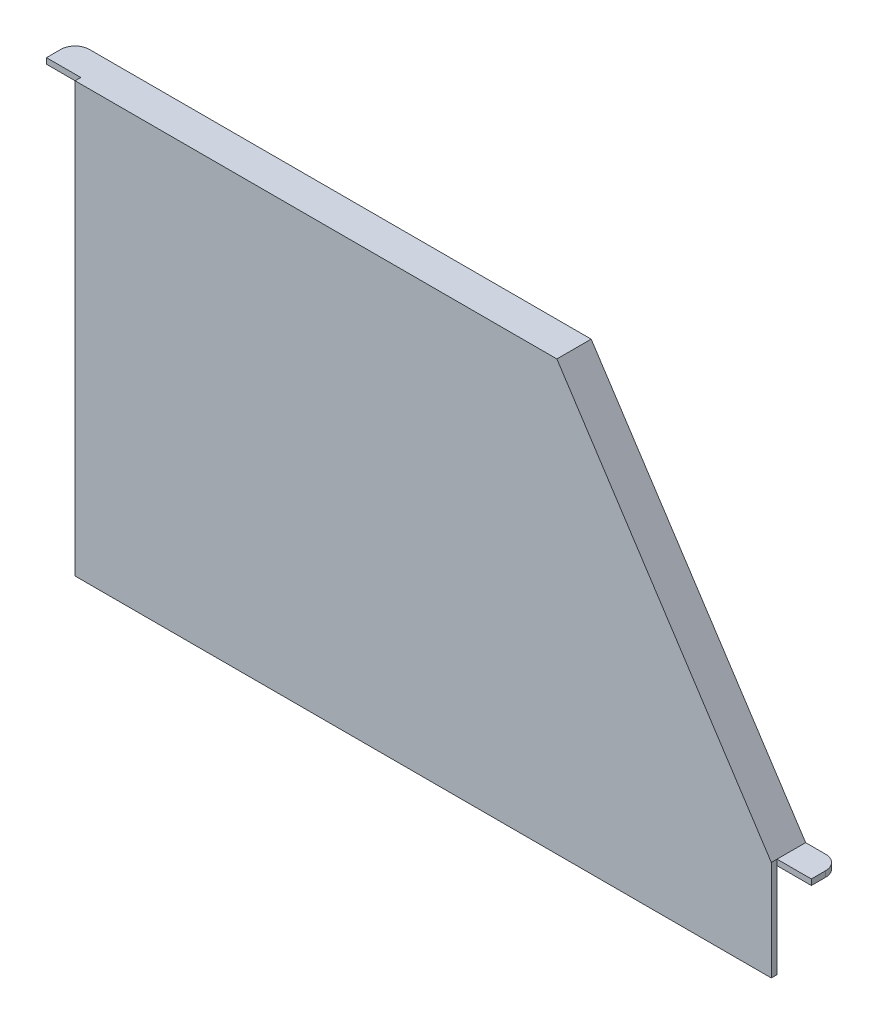
ISO-10303-21;
HEADER;
FILE_DESCRIPTION(('STEP AP214'),'2;1');
FILE_NAME('part.step','',(''),(''),'','','');
FILE_SCHEMA(('AUTOMOTIVE_DESIGN { 1 0 10303 214 1 1 1 1 }'));
ENDSEC;
DATA;
#1=APPLICATION_CONTEXT('core data for automotive mechanical design processes');
#2=APPLICATION_PROTOCOL_DEFINITION('international standard','automotive_design',2000,#1);
#3=PRODUCT_CONTEXT('',#1,'mechanical');
#4=PRODUCT('Part','Part','',(#3));
#5=PRODUCT_RELATED_PRODUCT_CATEGORY('part','',(#4));
#6=PRODUCT_DEFINITION_FORMATION('','',#4);
#7=PRODUCT_DEFINITION_CONTEXT('part definition',#1,'design');
#8=PRODUCT_DEFINITION('design','',#6,#7);
#9=PRODUCT_DEFINITION_SHAPE('','',#8);
#10=(LENGTH_UNIT() NAMED_UNIT(*) SI_UNIT(.MILLI.,.METRE.));
#11=(NAMED_UNIT(*) PLANE_ANGLE_UNIT() SI_UNIT($,.RADIAN.));
#12=(NAMED_UNIT(*) SI_UNIT($,.STERADIAN.) SOLID_ANGLE_UNIT());
#13=UNCERTAINTY_MEASURE_WITH_UNIT(LENGTH_MEASURE(1.E-05),#10,'distance_accuracy_value','');
#14=(GEOMETRIC_REPRESENTATION_CONTEXT(3) GLOBAL_UNCERTAINTY_ASSIGNED_CONTEXT((#13)) GLOBAL_UNIT_ASSIGNED_CONTEXT((#10,
#11,#12)) REPRESENTATION_CONTEXT('',''));
#15=CARTESIAN_POINT('',(0.,0.,0.));
#16=DIRECTION('',(0.,0.,1.));
#17=DIRECTION('',(1.,0.,0.));
#18=AXIS2_PLACEMENT_3D('',#15,#16,#17);
#19=CARTESIAN_POINT('',(0.,0.,4.));
#20=DIRECTION('',(1.,0.,0.));
#21=DIRECTION('',(0.,0.,-1.));
#22=AXIS2_PLACEMENT_3D('',#19,#20,#21);
#23=PLANE('',#22);
#24=DIRECTION('',(0.,1.,0.));
#25=VECTOR('',#24,1.);
#26=CARTESIAN_POINT('',(0.,296.,0.));
#27=LINE('',#26,#25);
#28=CARTESIAN_POINT('',(0.,296.,0.));
#29=VERTEX_POINT('',#28);
#30=CARTESIAN_POINT('',(0.,300.,0.));
#31=VERTEX_POINT('',#30);
#32=EDGE_CURVE('E142',#29,#31,#27,.T.);
#33=ORIENTED_EDGE('',*,*,#32,.F.);
#34=DIRECTION('',(0.,-1.,0.));
#35=VECTOR('',#34,1.);
#36=CARTESIAN_POINT('',(0.,0.,0.));
#37=LINE('',#36,#35);
#38=CARTESIAN_POINT('',(0.,0.,0.));
#39=VERTEX_POINT('',#38);
#40=EDGE_CURVE('E210',#29,#39,#37,.T.);
#41=ORIENTED_EDGE('',*,*,#40,.T.);
#42=DIRECTION('',(0.,0.,-1.));
#43=VECTOR('',#42,1.);
#44=CARTESIAN_POINT('',(0.,0.,4.));
#45=LINE('',#44,#43);
#46=CARTESIAN_POINT('',(0.,0.,4.));
#47=VERTEX_POINT('',#46);
#48=EDGE_CURVE('E218',#47,#39,#45,.T.);
#49=ORIENTED_EDGE('',*,*,#48,.F.);
#50=DIRECTION('',(0.,-1.,0.));
#51=VECTOR('',#50,1.);
#52=CARTESIAN_POINT('',(0.,0.,4.));
#53=LINE('',#52,#51);
#54=CARTESIAN_POINT('',(0.,300.,4.));
#55=VERTEX_POINT('',#54);
#56=EDGE_CURVE('E216',#55,#47,#53,.T.);
#57=ORIENTED_EDGE('',*,*,#56,.F.);
#58=DIRECTION('',(0.,0.,-1.));
#59=VECTOR('',#58,1.);
#60=CARTESIAN_POINT('',(0.,300.,4.));
#61=LINE('',#60,#59);
#62=EDGE_CURVE('E226',#55,#31,#61,.T.);
#63=ORIENTED_EDGE('',*,*,#62,.T.);
#64=EDGE_LOOP('',(#33,#41,#49,#57,#63));
#65=FACE_BOUND('',#64,.T.);
#66=ADVANCED_FACE('F34',(#65),#23,.F.);
#67=CARTESIAN_POINT('',(487.,70.,4.));
#68=DIRECTION('',(-1.,0.,0.));
#69=DIRECTION('',(0.,0.,1.));
#70=AXIS2_PLACEMENT_3D('',#67,#68,#69);
#71=PLANE('',#70);
#72=DIRECTION('',(0.,-1.,0.));
#73=VECTOR('',#72,1.);
#74=CARTESIAN_POINT('',(487.,70.,0.));
#75=LINE('',#74,#73);
#76=CARTESIAN_POINT('',(487.,70.,0.));
#77=VERTEX_POINT('',#76);
#78=CARTESIAN_POINT('',(487.,65.9999999999999,0.));
#79=VERTEX_POINT('',#78);
#80=EDGE_CURVE('E167',#77,#79,#75,.T.);
#81=ORIENTED_EDGE('',*,*,#80,.F.);
#82=DIRECTION('',(0.,0.,-1.));
#83=VECTOR('',#82,1.);
#84=CARTESIAN_POINT('',(487.,70.,4.));
#85=LINE('',#84,#83);
#86=CARTESIAN_POINT('',(487.,70.,4.));
#87=VERTEX_POINT('',#86);
#88=EDGE_CURVE('E231',#87,#77,#85,.T.);
#89=ORIENTED_EDGE('',*,*,#88,.F.);
#90=DIRECTION('',(0.,1.,0.));
#91=VECTOR('',#90,1.);
#92=CARTESIAN_POINT('',(487.,70.,4.));
#93=LINE('',#92,#91);
#94=CARTESIAN_POINT('',(487.,0.,4.));
#95=VERTEX_POINT('',#94);
#96=EDGE_CURVE('E209',#95,#87,#93,.T.);
#97=ORIENTED_EDGE('',*,*,#96,.F.);
#98=DIRECTION('',(0.,0.,-1.));
#99=VECTOR('',#98,1.);
#100=CARTESIAN_POINT('',(487.,0.,4.));
#101=LINE('',#100,#99);
#102=CARTESIAN_POINT('',(487.,0.,0.));
#103=VERTEX_POINT('',#102);
#104=EDGE_CURVE('E234',#95,#103,#101,.T.);
#105=ORIENTED_EDGE('',*,*,#104,.T.);
#106=DIRECTION('',(0.,1.,0.));
#107=VECTOR('',#106,1.);
#108=CARTESIAN_POINT('',(487.,70.,0.));
#109=LINE('',#108,#107);
#110=EDGE_CURVE('E221',#103,#79,#109,.T.);
#111=ORIENTED_EDGE('',*,*,#110,.T.);
#112=EDGE_LOOP('',(#81,#89,#97,#105,#111));
#113=FACE_BOUND('',#112,.T.);
#114=ADVANCED_FACE('F260',(#113),#71,.F.);
#115=CARTESIAN_POINT('',(0.,0.,0.));
#116=DIRECTION('',(0.,0.,-1.));
#117=DIRECTION('',(-1.,0.,0.));
#118=AXIS2_PLACEMENT_3D('',#115,#116,#117);
#119=PLANE('',#118);
#120=DIRECTION('',(-1.,0.,0.));
#121=VECTOR('',#120,1.);
#122=CARTESIAN_POINT('',(0.,296.,0.));
#123=LINE('',#122,#121);
#124=CARTESIAN_POINT('',(337.,296.,0.));
#125=VERTEX_POINT('',#124);
#126=EDGE_CURVE('E150',#125,#29,#123,.T.);
#127=ORIENTED_EDGE('',*,*,#126,.F.);
#128=DIRECTION('',(-0.546267780546922,0.837610596838614,0.));
#129=VECTOR('',#128,1.);
#130=CARTESIAN_POINT('',(337.,296.,0.));
#131=LINE('',#130,#129);
#132=EDGE_CURVE('E186',#79,#125,#131,.T.);
#133=ORIENTED_EDGE('',*,*,#132,.F.);
#134=ORIENTED_EDGE('',*,*,#110,.F.);
#135=DIRECTION('',(1.,0.,0.));
#136=VECTOR('',#135,1.);
#137=CARTESIAN_POINT('',(487.,0.,0.));
#138=LINE('',#137,#136);
#139=EDGE_CURVE('E205',#39,#103,#138,.T.);
#140=ORIENTED_EDGE('',*,*,#139,.F.);
#141=ORIENTED_EDGE('',*,*,#40,.F.);
#142=EDGE_LOOP('',(#127,#133,#134,#140,#141));
#143=FACE_BOUND('',#142,.T.);
#144=ADVANCED_FACE('F266',(#143),#119,.T.);
#145=CARTESIAN_POINT('',(487.,0.,4.));
#146=DIRECTION('',(0.,1.,0.));
#147=DIRECTION('',(-1.,0.,0.));
#148=AXIS2_PLACEMENT_3D('',#145,#146,#147);
#149=PLANE('',#148);
#150=ORIENTED_EDGE('',*,*,#139,.T.);
#151=ORIENTED_EDGE('',*,*,#104,.F.);
#152=DIRECTION('',(1.,0.,0.));
#153=VECTOR('',#152,1.);
#154=CARTESIAN_POINT('',(487.,0.,4.));
#155=LINE('',#154,#153);
#156=EDGE_CURVE('E206',#47,#95,#155,.T.);
#157=ORIENTED_EDGE('',*,*,#156,.F.);
#158=ORIENTED_EDGE('',*,*,#48,.T.);
#159=EDGE_LOOP('',(#150,#151,#157,#158));
#160=FACE_BOUND('',#159,.T.);
#161=ADVANCED_FACE('F278',(#160),#149,.F.);
#162=CARTESIAN_POINT('',(337.,300.,4.));
#163=DIRECTION('',(-0.837610596838614,-0.546267780546922,0.));
#164=DIRECTION('',(0.546267780546922,-0.837610596838614,0.));
#165=AXIS2_PLACEMENT_3D('',#162,#163,#164);
#166=PLANE('',#165);
#167=ORIENTED_EDGE('',*,*,#88,.T.);
#168=DIRECTION('',(0.,0.,1.));
#169=VECTOR('',#168,1.);
#170=CARTESIAN_POINT('',(487.,70.,-20.));
#171=LINE('',#170,#169);
#172=CARTESIAN_POINT('',(487.,70.,-20.));
#173=VERTEX_POINT('',#172);
#174=EDGE_CURVE('E153',#173,#77,#171,.T.);
#175=ORIENTED_EDGE('',*,*,#174,.F.);
#176=DIRECTION('',(0.546267780546922,-0.837610596838614,0.));
#177=VECTOR('',#176,1.);
#178=CARTESIAN_POINT('',(487.,70.,-20.));
#179=LINE('',#178,#177);
#180=CARTESIAN_POINT('',(337.,300.,-20.));
#181=VERTEX_POINT('',#180);
#182=EDGE_CURVE('E187',#181,#173,#179,.T.);
#183=ORIENTED_EDGE('',*,*,#182,.F.);
#184=DIRECTION('',(0.,0.,-1.));
#185=VECTOR('',#184,1.);
#186=CARTESIAN_POINT('',(337.,300.,4.));
#187=LINE('',#186,#185);
#188=CARTESIAN_POINT('',(337.,300.,4.));
#189=VERTEX_POINT('',#188);
#190=EDGE_CURVE('E228',#189,#181,#187,.T.);
#191=ORIENTED_EDGE('',*,*,#190,.F.);
#192=DIRECTION('',(-0.546267780546922,0.837610596838614,0.));
#193=VECTOR('',#192,1.);
#194=CARTESIAN_POINT('',(337.,300.,4.));
#195=LINE('',#194,#193);
#196=EDGE_CURVE('E212',#87,#189,#195,.T.);
#197=ORIENTED_EDGE('',*,*,#196,.F.);
#198=EDGE_LOOP('',(#167,#175,#183,#191,#197));
#199=FACE_BOUND('',#198,.T.);
#200=ADVANCED_FACE('F276',(#199),#166,.F.);
#201=CARTESIAN_POINT('',(0.,300.,4.));
#202=DIRECTION('',(0.,-1.,0.));
#203=DIRECTION('',(0.,0.,-1.));
#204=AXIS2_PLACEMENT_3D('',#201,#202,#203);
#205=PLANE('',#204);
#206=DIRECTION('',(1.,0.,0.));
#207=VECTOR('',#206,1.);
#208=CARTESIAN_POINT('',(0.,300.,-20.));
#209=LINE('',#208,#207);
#210=CARTESIAN_POINT('',(-14.,300.,-20.));
#211=VERTEX_POINT('',#210);
#212=EDGE_CURVE('E197',#211,#181,#209,.T.);
#213=ORIENTED_EDGE('',*,*,#212,.F.);
#214=CARTESIAN_POINT('',(-14.,300.,-10.));
#215=DIRECTION('',(0.,-1.,0.));
#216=DIRECTION('',(0.,0.,-1.));
#217=AXIS2_PLACEMENT_3D('',#214,#215,#216);
#218=CIRCLE('',#217,10.);
#219=CARTESIAN_POINT('',(-24.,300.,-10.));
#220=VERTEX_POINT('',#219);
#221=EDGE_CURVE('E11',#211,#220,#218,.F.);
#222=ORIENTED_EDGE('',*,*,#221,.T.);
#223=DIRECTION('',(0.,0.,-1.));
#224=VECTOR('',#223,1.);
#225=CARTESIAN_POINT('',(-24.,300.,-20.));
#226=LINE('',#225,#224);
#227=CARTESIAN_POINT('',(-24.,300.,0.));
#228=VERTEX_POINT('',#227);
#229=EDGE_CURVE('E158',#228,#220,#226,.T.);
#230=ORIENTED_EDGE('',*,*,#229,.F.);
#231=DIRECTION('',(1.,0.,0.));
#232=VECTOR('',#231,1.);
#233=CARTESIAN_POINT('',(-24.,300.,0.));
#234=LINE('',#233,#232);
#235=EDGE_CURVE('E154',#228,#31,#234,.T.);
#236=ORIENTED_EDGE('',*,*,#235,.T.);
#237=ORIENTED_EDGE('',*,*,#62,.F.);
#238=DIRECTION('',(-1.,0.,0.));
#239=VECTOR('',#238,1.);
#240=CARTESIAN_POINT('',(0.,300.,4.));
#241=LINE('',#240,#239);
#242=EDGE_CURVE('E214',#189,#55,#241,.T.);
#243=ORIENTED_EDGE('',*,*,#242,.F.);
#244=ORIENTED_EDGE('',*,*,#190,.T.);
#245=EDGE_LOOP('',(#213,#222,#230,#236,#237,#243,#244));
#246=FACE_BOUND('',#245,.T.);
#247=ADVANCED_FACE('F272',(#246),#205,.F.);
#248=CARTESIAN_POINT('',(0.,0.,4.));
#249=DIRECTION('',(0.,0.,-1.));
#250=DIRECTION('',(-1.,0.,0.));
#251=AXIS2_PLACEMENT_3D('',#248,#249,#250);
#252=PLANE('',#251);
#253=ORIENTED_EDGE('',*,*,#156,.T.);
#254=ORIENTED_EDGE('',*,*,#96,.T.);
#255=ORIENTED_EDGE('',*,*,#196,.T.);
#256=ORIENTED_EDGE('',*,*,#242,.T.);
#257=ORIENTED_EDGE('',*,*,#56,.T.);
#258=EDGE_LOOP('',(#253,#254,#255,#256,#257));
#259=FACE_BOUND('',#258,.T.);
#260=ADVANCED_FACE('F275',(#259),#252,.F.);
#261=CARTESIAN_POINT('',(0.,296.,-20.));
#262=DIRECTION('',(0.,1.,0.));
#263=DIRECTION('',(-1.,0.,0.));
#264=AXIS2_PLACEMENT_3D('',#261,#262,#263);
#265=PLANE('',#264);
#266=DIRECTION('',(0.,0.,1.));
#267=VECTOR('',#266,1.);
#268=CARTESIAN_POINT('',(-24.,296.,-20.));
#269=LINE('',#268,#267);
#270=CARTESIAN_POINT('',(-24.,296.,-10.));
#271=VERTEX_POINT('',#270);
#272=CARTESIAN_POINT('',(-24.,296.,0.));
#273=VERTEX_POINT('',#272);
#274=EDGE_CURVE('E134',#271,#273,#269,.T.);
#275=ORIENTED_EDGE('',*,*,#274,.F.);
#276=CARTESIAN_POINT('',(-14.,296.,-10.));
#277=DIRECTION('',(0.,1.,0.));
#278=DIRECTION('',(-1.,0.,0.));
#279=AXIS2_PLACEMENT_3D('',#276,#277,#278);
#280=CIRCLE('',#279,10.);
#281=CARTESIAN_POINT('',(-14.,296.,-20.));
#282=VERTEX_POINT('',#281);
#283=EDGE_CURVE('E42',#271,#282,#280,.F.);
#284=ORIENTED_EDGE('',*,*,#283,.T.);
#285=DIRECTION('',(-1.,0.,0.));
#286=VECTOR('',#285,1.);
#287=CARTESIAN_POINT('',(0.,296.,-20.));
#288=LINE('',#287,#286);
#289=CARTESIAN_POINT('',(337.,296.,-20.));
#290=VERTEX_POINT('',#289);
#291=EDGE_CURVE('E199',#290,#282,#288,.T.);
#292=ORIENTED_EDGE('',*,*,#291,.F.);
#293=DIRECTION('',(0.,0.,1.));
#294=VECTOR('',#293,1.);
#295=CARTESIAN_POINT('',(337.,296.,-20.));
#296=LINE('',#295,#294);
#297=EDGE_CURVE('E202',#290,#125,#296,.T.);
#298=ORIENTED_EDGE('',*,*,#297,.T.);
#299=ORIENTED_EDGE('',*,*,#126,.T.);
#300=DIRECTION('',(1.,0.,0.));
#301=VECTOR('',#300,1.);
#302=CARTESIAN_POINT('',(-24.,296.,0.));
#303=LINE('',#302,#301);
#304=EDGE_CURVE('E146',#273,#29,#303,.T.);
#305=ORIENTED_EDGE('',*,*,#304,.F.);
#306=EDGE_LOOP('',(#275,#284,#292,#298,#299,#305));
#307=FACE_BOUND('',#306,.T.);
#308=ADVANCED_FACE('F147',(#307),#265,.F.);
#309=CARTESIAN_POINT('',(0.,0.,-20.));
#310=DIRECTION('',(0.,0.,1.));
#311=DIRECTION('',(1.,0.,0.));
#312=AXIS2_PLACEMENT_3D('',#309,#310,#311);
#313=PLANE('',#312);
#314=DIRECTION('',(-1.,0.,0.));
#315=VECTOR('',#314,1.);
#316=CARTESIAN_POINT('',(511.,70.,-20.));
#317=LINE('',#316,#315);
#318=CARTESIAN_POINT('',(501.,70.,-20.));
#319=VERTEX_POINT('',#318);
#320=EDGE_CURVE('E184',#319,#173,#317,.T.);
#321=ORIENTED_EDGE('',*,*,#320,.F.);
#322=DIRECTION('',(0.,1.,0.));
#323=VECTOR('',#322,1.);
#324=CARTESIAN_POINT('',(501.,0.,-20.));
#325=LINE('',#324,#323);
#326=CARTESIAN_POINT('',(501.,65.9999999999999,-20.));
#327=VERTEX_POINT('',#326);
#328=EDGE_CURVE('E244',#319,#327,#325,.F.);
#329=ORIENTED_EDGE('',*,*,#328,.T.);
#330=DIRECTION('',(-1.,0.,0.));
#331=VECTOR('',#330,1.);
#332=CARTESIAN_POINT('',(511.,65.9999999999999,-20.));
#333=LINE('',#332,#331);
#334=CARTESIAN_POINT('',(487.,65.9999999999999,-20.));
#335=VERTEX_POINT('',#334);
#336=EDGE_CURVE('E172',#327,#335,#333,.T.);
#337=ORIENTED_EDGE('',*,*,#336,.T.);
#338=DIRECTION('',(-0.546267780546922,0.837610596838614,0.));
#339=VECTOR('',#338,1.);
#340=CARTESIAN_POINT('',(337.,296.,-20.));
#341=LINE('',#340,#339);
#342=EDGE_CURVE('E190',#335,#290,#341,.T.);
#343=ORIENTED_EDGE('',*,*,#342,.T.);
#344=ORIENTED_EDGE('',*,*,#291,.T.);
#345=DIRECTION('',(0.,-1.,0.));
#346=VECTOR('',#345,1.);
#347=CARTESIAN_POINT('',(-14.,0.,-20.));
#348=LINE('',#347,#346);
#349=EDGE_CURVE('E242',#282,#211,#348,.F.);
#350=ORIENTED_EDGE('',*,*,#349,.T.);
#351=ORIENTED_EDGE('',*,*,#212,.T.);
#352=ORIENTED_EDGE('',*,*,#182,.T.);
#353=EDGE_LOOP('',(#321,#329,#337,#343,#344,#350,#351,#352));
#354=FACE_BOUND('',#353,.T.);
#355=ADVANCED_FACE('F251',(#354),#313,.F.);
#356=CARTESIAN_POINT('',(337.,296.,-20.));
#357=DIRECTION('',(0.837610596838614,0.546267780546922,0.));
#358=DIRECTION('',(-0.546267780546922,0.837610596838614,0.));
#359=AXIS2_PLACEMENT_3D('',#356,#357,#358);
#360=PLANE('',#359);
#361=ORIENTED_EDGE('',*,*,#132,.T.);
#362=ORIENTED_EDGE('',*,*,#297,.F.);
#363=ORIENTED_EDGE('',*,*,#342,.F.);
#364=DIRECTION('',(0.,0.,1.));
#365=VECTOR('',#364,1.);
#366=CARTESIAN_POINT('',(487.,65.9999999999999,-20.));
#367=LINE('',#366,#365);
#368=EDGE_CURVE('E193',#335,#79,#367,.T.);
#369=ORIENTED_EDGE('',*,*,#368,.T.);
#370=EDGE_LOOP('',(#361,#362,#363,#369));
#371=FACE_BOUND('',#370,.T.);
#372=ADVANCED_FACE('F320',(#371),#360,.F.);
#373=CARTESIAN_POINT('',(511.,70.,-20.));
#374=DIRECTION('',(0.,-1.,0.));
#375=DIRECTION('',(0.,0.,-1.));
#376=AXIS2_PLACEMENT_3D('',#373,#374,#375);
#377=PLANE('',#376);
#378=DIRECTION('',(0.,0.,1.));
#379=VECTOR('',#378,1.);
#380=CARTESIAN_POINT('',(511.,70.,-20.));
#381=LINE('',#380,#379);
#382=CARTESIAN_POINT('',(511.,70.,-10.));
#383=VERTEX_POINT('',#382);
#384=CARTESIAN_POINT('',(511.,70.,0.));
#385=VERTEX_POINT('',#384);
#386=EDGE_CURVE('E164',#383,#385,#381,.T.);
#387=ORIENTED_EDGE('',*,*,#386,.F.);
#388=CARTESIAN_POINT('',(501.,70.,-10.));
#389=DIRECTION('',(0.,-1.,0.));
#390=DIRECTION('',(0.,0.,-1.));
#391=AXIS2_PLACEMENT_3D('',#388,#389,#390);
#392=CIRCLE('',#391,10.);
#393=EDGE_CURVE('E240',#383,#319,#392,.F.);
#394=ORIENTED_EDGE('',*,*,#393,.T.);
#395=ORIENTED_EDGE('',*,*,#320,.T.);
#396=ORIENTED_EDGE('',*,*,#174,.T.);
#397=DIRECTION('',(-1.,0.,0.));
#398=VECTOR('',#397,1.);
#399=CARTESIAN_POINT('',(511.,70.,0.));
#400=LINE('',#399,#398);
#401=EDGE_CURVE('E181',#385,#77,#400,.T.);
#402=ORIENTED_EDGE('',*,*,#401,.F.);
#403=EDGE_LOOP('',(#387,#394,#395,#396,#402));
#404=FACE_BOUND('',#403,.T.);
#405=ADVANCED_FACE('F322',(#404),#377,.F.);
#406=CARTESIAN_POINT('',(511.,70.,0.));
#407=DIRECTION('',(0.,0.,-1.));
#408=DIRECTION('',(-1.,0.,0.));
#409=AXIS2_PLACEMENT_3D('',#406,#407,#408);
#410=PLANE('',#409);
#411=ORIENTED_EDGE('',*,*,#80,.T.);
#412=DIRECTION('',(-1.,0.,0.));
#413=VECTOR('',#412,1.);
#414=CARTESIAN_POINT('',(511.,65.9999999999999,0.));
#415=LINE('',#414,#413);
#416=CARTESIAN_POINT('',(511.,65.9999999999999,0.));
#417=VERTEX_POINT('',#416);
#418=EDGE_CURVE('E178',#417,#79,#415,.T.);
#419=ORIENTED_EDGE('',*,*,#418,.F.);
#420=DIRECTION('',(0.,-1.,0.));
#421=VECTOR('',#420,1.);
#422=CARTESIAN_POINT('',(511.,70.,0.));
#423=LINE('',#422,#421);
#424=EDGE_CURVE('E166',#385,#417,#423,.T.);
#425=ORIENTED_EDGE('',*,*,#424,.F.);
#426=ORIENTED_EDGE('',*,*,#401,.T.);
#427=EDGE_LOOP('',(#411,#419,#425,#426));
#428=FACE_BOUND('',#427,.T.);
#429=ADVANCED_FACE('F318',(#428),#410,.F.);
#430=CARTESIAN_POINT('',(511.,65.9999999999999,-20.));
#431=DIRECTION('',(0.,1.,0.));
#432=DIRECTION('',(0.,0.,1.));
#433=AXIS2_PLACEMENT_3D('',#430,#431,#432);
#434=PLANE('',#433);
#435=ORIENTED_EDGE('',*,*,#336,.F.);
#436=CARTESIAN_POINT('',(501.,65.9999999999999,-10.));
#437=DIRECTION('',(0.,1.,0.));
#438=DIRECTION('',(0.,0.,1.));
#439=AXIS2_PLACEMENT_3D('',#436,#437,#438);
#440=CIRCLE('',#439,10.);
#441=CARTESIAN_POINT('',(511.,65.9999999999999,-10.));
#442=VERTEX_POINT('',#441);
#443=EDGE_CURVE('E246',#327,#442,#440,.F.);
#444=ORIENTED_EDGE('',*,*,#443,.T.);
#445=DIRECTION('',(0.,0.,-1.));
#446=VECTOR('',#445,1.);
#447=CARTESIAN_POINT('',(511.,65.9999999999999,-20.));
#448=LINE('',#447,#446);
#449=EDGE_CURVE('E169',#417,#442,#448,.T.);
#450=ORIENTED_EDGE('',*,*,#449,.F.);
#451=ORIENTED_EDGE('',*,*,#418,.T.);
#452=ORIENTED_EDGE('',*,*,#368,.F.);
#453=EDGE_LOOP('',(#435,#444,#450,#451,#452));
#454=FACE_BOUND('',#453,.T.);
#455=ADVANCED_FACE('F309',(#454),#434,.F.);
#456=CARTESIAN_POINT('',(511.,0.,0.));
#457=DIRECTION('',(-1.,0.,0.));
#458=DIRECTION('',(0.,0.,1.));
#459=AXIS2_PLACEMENT_3D('',#456,#457,#458);
#460=PLANE('',#459);
#461=ORIENTED_EDGE('',*,*,#449,.T.);
#462=DIRECTION('',(0.,1.,0.));
#463=VECTOR('',#462,1.);
#464=CARTESIAN_POINT('',(511.,0.,-10.));
#465=LINE('',#464,#463);
#466=EDGE_CURVE('E237',#442,#383,#465,.T.);
#467=ORIENTED_EDGE('',*,*,#466,.T.);
#468=ORIENTED_EDGE('',*,*,#386,.T.);
#469=ORIENTED_EDGE('',*,*,#424,.T.);
#470=EDGE_LOOP('',(#461,#467,#468,#469));
#471=FACE_BOUND('',#470,.T.);
#472=ADVANCED_FACE('F312',(#471),#460,.F.);
#473=CARTESIAN_POINT('',(-24.,296.,0.));
#474=DIRECTION('',(0.,0.,-1.));
#475=DIRECTION('',(-1.,0.,0.));
#476=AXIS2_PLACEMENT_3D('',#473,#474,#475);
#477=PLANE('',#476);
#478=ORIENTED_EDGE('',*,*,#32,.T.);
#479=ORIENTED_EDGE('',*,*,#235,.F.);
#480=DIRECTION('',(0.,1.,0.));
#481=VECTOR('',#480,1.);
#482=CARTESIAN_POINT('',(-24.,296.,0.));
#483=LINE('',#482,#481);
#484=EDGE_CURVE('E138',#273,#228,#483,.T.);
#485=ORIENTED_EDGE('',*,*,#484,.F.);
#486=ORIENTED_EDGE('',*,*,#304,.T.);
#487=EDGE_LOOP('',(#478,#479,#485,#486));
#488=FACE_BOUND('',#487,.T.);
#489=ADVANCED_FACE('F156',(#488),#477,.F.);
#490=CARTESIAN_POINT('',(-24.,0.,0.));
#491=DIRECTION('',(1.,0.,0.));
#492=DIRECTION('',(0.,0.,-1.));
#493=AXIS2_PLACEMENT_3D('',#490,#491,#492);
#494=PLANE('',#493);
#495=ORIENTED_EDGE('',*,*,#229,.T.);
#496=DIRECTION('',(0.,-1.,0.));
#497=VECTOR('',#496,1.);
#498=CARTESIAN_POINT('',(-24.,0.,-10.));
#499=LINE('',#498,#497);
#500=EDGE_CURVE('E140',#220,#271,#499,.T.);
#501=ORIENTED_EDGE('',*,*,#500,.T.);
#502=ORIENTED_EDGE('',*,*,#274,.T.);
#503=ORIENTED_EDGE('',*,*,#484,.T.);
#504=EDGE_LOOP('',(#495,#501,#502,#503));
#505=FACE_BOUND('',#504,.T.);
#506=ADVANCED_FACE('F136',(#505),#494,.F.);
#507=CARTESIAN_POINT('',(501.,0.,-10.));
#508=DIRECTION('',(0.,1.,0.));
#509=DIRECTION('',(0.,0.,1.));
#510=AXIS2_PLACEMENT_3D('',#507,#508,#509);
#511=CYLINDRICAL_SURFACE('',#510,10.);
#512=ORIENTED_EDGE('',*,*,#443,.F.);
#513=ORIENTED_EDGE('',*,*,#328,.F.);
#514=ORIENTED_EDGE('',*,*,#393,.F.);
#515=ORIENTED_EDGE('',*,*,#466,.F.);
#516=EDGE_LOOP('',(#512,#513,#514,#515));
#517=FACE_BOUND('',#516,.T.);
#518=ADVANCED_FACE('F254',(#517),#511,.T.);
#519=CARTESIAN_POINT('',(-14.,0.,-10.));
#520=DIRECTION('',(0.,-1.,0.));
#521=DIRECTION('',(0.,0.,-1.));
#522=AXIS2_PLACEMENT_3D('',#519,#520,#521);
#523=CYLINDRICAL_SURFACE('',#522,10.);
#524=ORIENTED_EDGE('',*,*,#221,.F.);
#525=ORIENTED_EDGE('',*,*,#349,.F.);
#526=ORIENTED_EDGE('',*,*,#283,.F.);
#527=ORIENTED_EDGE('',*,*,#500,.F.);
#528=EDGE_LOOP('',(#524,#525,#526,#527));
#529=FACE_BOUND('',#528,.T.);
#530=ADVANCED_FACE('F36',(#529),#523,.T.);
#531=CLOSED_SHELL('',(#66,#114,#144,#161,#200,#247,#260,#308,#355,#372,#405,#429,#455,#472,#489,
#506,#518,#530));
#532=MANIFOLD_SOLID_BREP('B2',#531);
#533=ADVANCED_BREP_SHAPE_REPRESENTATION('',(#18,#532),#14);
#534=SHAPE_DEFINITION_REPRESENTATION(#9,#533);
ENDSEC;
END-ISO-10303-21;
